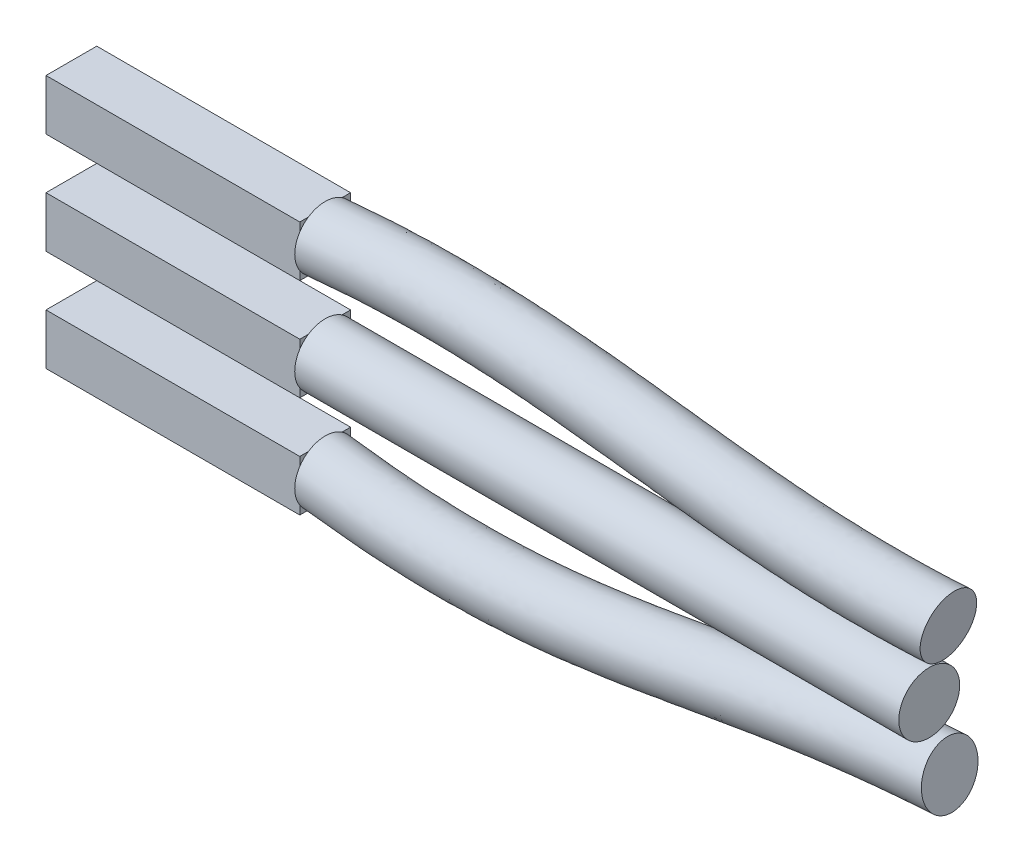
ISO-10303-21;
HEADER;
FILE_DESCRIPTION(('STEP AP214'),'2;1');
FILE_NAME('part.step','',(''),(''),'','','');
FILE_SCHEMA(('AUTOMOTIVE_DESIGN { 1 0 10303 214 1 1 1 1 }'));
ENDSEC;
DATA;
#1=APPLICATION_CONTEXT('core data for automotive mechanical design processes');
#2=APPLICATION_PROTOCOL_DEFINITION('international standard','automotive_design',2000,#1);
#3=PRODUCT_CONTEXT('',#1,'mechanical');
#4=PRODUCT('Part','Part','',(#3));
#5=PRODUCT_RELATED_PRODUCT_CATEGORY('part','',(#4));
#6=PRODUCT_DEFINITION_FORMATION('','',#4);
#7=PRODUCT_DEFINITION_CONTEXT('part definition',#1,'design');
#8=PRODUCT_DEFINITION('design','',#6,#7);
#9=PRODUCT_DEFINITION_SHAPE('','',#8);
#10=(LENGTH_UNIT() NAMED_UNIT(*) SI_UNIT(.MILLI.,.METRE.));
#11=(NAMED_UNIT(*) PLANE_ANGLE_UNIT() SI_UNIT($,.RADIAN.));
#12=(NAMED_UNIT(*) SI_UNIT($,.STERADIAN.) SOLID_ANGLE_UNIT());
#13=UNCERTAINTY_MEASURE_WITH_UNIT(LENGTH_MEASURE(1.E-05),#10,'distance_accuracy_value','');
#14=(GEOMETRIC_REPRESENTATION_CONTEXT(3) GLOBAL_UNCERTAINTY_ASSIGNED_CONTEXT((#13)) GLOBAL_UNIT_ASSIGNED_CONTEXT((#10,
#11,#12)) REPRESENTATION_CONTEXT('',''));
#15=CARTESIAN_POINT('',(0.,0.,0.));
#16=DIRECTION('',(0.,0.,1.));
#17=DIRECTION('',(1.,0.,0.));
#18=AXIS2_PLACEMENT_3D('',#15,#16,#17);
#19=CARTESIAN_POINT('',(5.01124009742201,3.10694238337395,1.));
#20=DIRECTION('',(-1.,0.,0.));
#21=DIRECTION('',(0.,0.,1.));
#22=AXIS2_PLACEMENT_3D('',#19,#20,#21);
#23=PLANE('',#22);
#24=CARTESIAN_POINT('',(5.01124009742201,2.60694238337396,0.5));
#25=DIRECTION('',(1.,0.,0.));
#26=DIRECTION('',(0.,0.,-1.));
#27=AXIS2_PLACEMENT_3D('',#24,#25,#26);
#28=CIRCLE('',#27,0.6);
#29=CARTESIAN_POINT('',(5.01124009742201,2.9386048624095,0.));
#30=VERTEX_POINT('',#29);
#31=CARTESIAN_POINT('',(5.01124009742201,3.10694238337395,0.168337520964433));
#32=VERTEX_POINT('',#31);
#33=EDGE_CURVE('E12',#30,#32,#28,.T.);
#34=ORIENTED_EDGE('',*,*,#33,.F.);
#35=DIRECTION('',(0.,1.,0.));
#36=VECTOR('',#35,1.);
#37=CARTESIAN_POINT('',(5.01124009742201,3.10694238337395,0.));
#38=LINE('',#37,#36);
#39=CARTESIAN_POINT('',(5.01124009742201,3.10694238337395,0.));
#40=VERTEX_POINT('',#39);
#41=EDGE_CURVE('E123',#30,#40,#38,.T.);
#42=ORIENTED_EDGE('',*,*,#41,.T.);
#43=DIRECTION('',(0.,0.,-1.));
#44=VECTOR('',#43,1.);
#45=CARTESIAN_POINT('',(5.01124009742201,3.10694238337395,1.));
#46=LINE('',#45,#44);
#47=EDGE_CURVE('E158',#32,#40,#46,.T.);
#48=ORIENTED_EDGE('',*,*,#47,.F.);
#49=EDGE_LOOP('',(#34,#42,#48));
#50=FACE_BOUND('',#49,.T.);
#51=ADVANCED_FACE('F46',(#50),#23,.F.);
#52=CARTESIAN_POINT('',(5.01124009742201,3.10694238337395,0.831662479035567));
#53=VERTEX_POINT('',#52);
#54=CARTESIAN_POINT('',(5.01124009742201,2.9386048624095,1.));
#55=VERTEX_POINT('',#54);
#56=EDGE_CURVE('E55',#53,#55,#28,.T.);
#57=ORIENTED_EDGE('',*,*,#56,.F.);
#58=CARTESIAN_POINT('',(5.01124009742201,3.10694238337395,1.));
#59=VERTEX_POINT('',#58);
#60=EDGE_CURVE('E50',#59,#53,#46,.T.);
#61=ORIENTED_EDGE('',*,*,#60,.F.);
#62=DIRECTION('',(0.,1.,0.));
#63=VECTOR('',#62,1.);
#64=CARTESIAN_POINT('',(5.01124009742201,3.10694238337395,1.));
#65=LINE('',#64,#63);
#66=EDGE_CURVE('E138',#55,#59,#65,.T.);
#67=ORIENTED_EDGE('',*,*,#66,.F.);
#68=EDGE_LOOP('',(#57,#61,#67));
#69=FACE_BOUND('',#68,.T.);
#70=ADVANCED_FACE('F182',(#69),#23,.F.);
#71=CARTESIAN_POINT('',(5.01124009742201,2.27527990433842,1.));
#72=VERTEX_POINT('',#71);
#73=CARTESIAN_POINT('',(5.01124009742201,2.10694238337398,0.831662479035564));
#74=VERTEX_POINT('',#73);
#75=EDGE_CURVE('E170',#72,#74,#28,.T.);
#76=ORIENTED_EDGE('',*,*,#75,.F.);
#77=CARTESIAN_POINT('',(5.01124009742201,2.10694238337398,1.));
#78=VERTEX_POINT('',#77);
#79=EDGE_CURVE('E133',#78,#72,#65,.T.);
#80=ORIENTED_EDGE('',*,*,#79,.F.);
#81=DIRECTION('',(0.,0.,-1.));
#82=VECTOR('',#81,1.);
#83=CARTESIAN_POINT('',(5.01124009742201,2.10694238337398,1.));
#84=LINE('',#83,#82);
#85=EDGE_CURVE('E152',#78,#74,#84,.T.);
#86=ORIENTED_EDGE('',*,*,#85,.T.);
#87=EDGE_LOOP('',(#76,#80,#86));
#88=FACE_BOUND('',#87,.T.);
#89=ADVANCED_FACE('F222',(#88),#23,.F.);
#90=CARTESIAN_POINT('',(5.01124009742201,2.10694238337398,0.168337520964436));
#91=VERTEX_POINT('',#90);
#92=CARTESIAN_POINT('',(5.01124009742201,2.27527990433842,0.));
#93=VERTEX_POINT('',#92);
#94=EDGE_CURVE('E64',#91,#93,#28,.T.);
#95=ORIENTED_EDGE('',*,*,#94,.F.);
#96=CARTESIAN_POINT('',(5.01124009742201,2.10694238337398,0.));
#97=VERTEX_POINT('',#96);
#98=EDGE_CURVE('E143',#91,#97,#84,.T.);
#99=ORIENTED_EDGE('',*,*,#98,.T.);
#100=EDGE_CURVE('E129',#97,#93,#38,.T.);
#101=ORIENTED_EDGE('',*,*,#100,.T.);
#102=EDGE_LOOP('',(#95,#99,#101));
#103=FACE_BOUND('',#102,.T.);
#104=ADVANCED_FACE('F48',(#103),#23,.F.);
#105=CARTESIAN_POINT('',(0.0112400974220052,3.10694238337395,1.));
#106=DIRECTION('',(0.,-1.,0.));
#107=DIRECTION('',(1.,0.,0.));
#108=AXIS2_PLACEMENT_3D('',#105,#106,#107);
#109=PLANE('',#108);
#110=DIRECTION('',(-1.,0.,0.));
#111=VECTOR('',#110,1.);
#112=CARTESIAN_POINT('',(0.0112400974220052,3.10694238337395,0.));
#113=LINE('',#112,#111);
#114=CARTESIAN_POINT('',(0.0112400974220052,3.10694238337395,0.));
#115=VERTEX_POINT('',#114);
#116=EDGE_CURVE('E145',#40,#115,#113,.T.);
#117=ORIENTED_EDGE('',*,*,#116,.T.);
#118=DIRECTION('',(0.,0.,-1.));
#119=VECTOR('',#118,1.);
#120=CARTESIAN_POINT('',(0.0112400974220052,3.10694238337395,1.));
#121=LINE('',#120,#119);
#122=CARTESIAN_POINT('',(0.0112400974220052,3.10694238337395,1.));
#123=VERTEX_POINT('',#122);
#124=EDGE_CURVE('E156',#123,#115,#121,.T.);
#125=ORIENTED_EDGE('',*,*,#124,.F.);
#126=DIRECTION('',(-1.,0.,0.));
#127=VECTOR('',#126,1.);
#128=CARTESIAN_POINT('',(0.0112400974220052,3.10694238337395,1.));
#129=LINE('',#128,#127);
#130=EDGE_CURVE('E136',#59,#123,#129,.T.);
#131=ORIENTED_EDGE('',*,*,#130,.F.);
#132=ORIENTED_EDGE('',*,*,#60,.T.);
#133=EDGE_CURVE('E163',#53,#32,#46,.T.);
#134=ORIENTED_EDGE('',*,*,#133,.T.);
#135=ORIENTED_EDGE('',*,*,#47,.T.);
#136=EDGE_LOOP('',(#117,#125,#131,#132,#134,#135));
#137=FACE_BOUND('',#136,.T.);
#138=ADVANCED_FACE('F205',(#137),#109,.F.);
#139=CARTESIAN_POINT('',(0.0112400974220054,2.10694238337398,1.));
#140=DIRECTION('',(1.,0.,0.));
#141=DIRECTION('',(0.,1.,0.));
#142=AXIS2_PLACEMENT_3D('',#139,#140,#141);
#143=PLANE('',#142);
#144=DIRECTION('',(0.,-1.,0.));
#145=VECTOR('',#144,1.);
#146=CARTESIAN_POINT('',(0.0112400974220054,2.10694238337398,0.));
#147=LINE('',#146,#145);
#148=CARTESIAN_POINT('',(0.0112400974220054,2.10694238337398,0.));
#149=VERTEX_POINT('',#148);
#150=EDGE_CURVE('E147',#115,#149,#147,.T.);
#151=ORIENTED_EDGE('',*,*,#150,.T.);
#152=DIRECTION('',(0.,0.,-1.));
#153=VECTOR('',#152,1.);
#154=CARTESIAN_POINT('',(0.0112400974220054,2.10694238337398,1.));
#155=LINE('',#154,#153);
#156=CARTESIAN_POINT('',(0.0112400974220054,2.10694238337398,1.));
#157=VERTEX_POINT('',#156);
#158=EDGE_CURVE('E154',#157,#149,#155,.T.);
#159=ORIENTED_EDGE('',*,*,#158,.F.);
#160=DIRECTION('',(0.,-1.,0.));
#161=VECTOR('',#160,1.);
#162=CARTESIAN_POINT('',(0.0112400974220054,2.10694238337398,1.));
#163=LINE('',#162,#161);
#164=EDGE_CURVE('E140',#123,#157,#163,.T.);
#165=ORIENTED_EDGE('',*,*,#164,.F.);
#166=ORIENTED_EDGE('',*,*,#124,.T.);
#167=EDGE_LOOP('',(#151,#159,#165,#166));
#168=FACE_BOUND('',#167,.T.);
#169=ADVANCED_FACE('F228',(#168),#143,.F.);
#170=CARTESIAN_POINT('',(5.01124009742201,2.10694238337398,1.));
#171=DIRECTION('',(0.,1.,0.));
#172=DIRECTION('',(-1.,0.,0.));
#173=AXIS2_PLACEMENT_3D('',#170,#171,#172);
#174=PLANE('',#173);
#175=DIRECTION('',(1.,0.,0.));
#176=VECTOR('',#175,1.);
#177=CARTESIAN_POINT('',(5.01124009742201,2.10694238337398,0.));
#178=LINE('',#177,#176);
#179=EDGE_CURVE('E149',#149,#97,#178,.T.);
#180=ORIENTED_EDGE('',*,*,#179,.T.);
#181=ORIENTED_EDGE('',*,*,#98,.F.);
#182=EDGE_CURVE('E71',#74,#91,#84,.T.);
#183=ORIENTED_EDGE('',*,*,#182,.F.);
#184=ORIENTED_EDGE('',*,*,#85,.F.);
#185=DIRECTION('',(1.,0.,0.));
#186=VECTOR('',#185,1.);
#187=CARTESIAN_POINT('',(5.01124009742201,2.10694238337398,1.));
#188=LINE('',#187,#186);
#189=EDGE_CURVE('E142',#157,#78,#188,.T.);
#190=ORIENTED_EDGE('',*,*,#189,.F.);
#191=ORIENTED_EDGE('',*,*,#158,.T.);
#192=EDGE_LOOP('',(#180,#181,#183,#184,#190,#191));
#193=FACE_BOUND('',#192,.T.);
#194=ADVANCED_FACE('F233',(#193),#174,.F.);
#195=CARTESIAN_POINT('',(0.,0.,1.));
#196=DIRECTION('',(0.,0.,-1.));
#197=DIRECTION('',(-1.,0.,0.));
#198=AXIS2_PLACEMENT_3D('',#195,#196,#197);
#199=PLANE('',#198);
#200=ORIENTED_EDGE('',*,*,#79,.T.);
#201=EDGE_CURVE('E137',#72,#55,#65,.T.);
#202=ORIENTED_EDGE('',*,*,#201,.T.);
#203=ORIENTED_EDGE('',*,*,#66,.T.);
#204=ORIENTED_EDGE('',*,*,#130,.T.);
#205=ORIENTED_EDGE('',*,*,#164,.T.);
#206=ORIENTED_EDGE('',*,*,#189,.T.);
#207=EDGE_LOOP('',(#200,#202,#203,#204,#205,#206));
#208=FACE_BOUND('',#207,.T.);
#209=ADVANCED_FACE('F186',(#208),#199,.F.);
#210=CARTESIAN_POINT('',(0.,0.,0.));
#211=DIRECTION('',(0.,0.,-1.));
#212=DIRECTION('',(-1.,0.,0.));
#213=AXIS2_PLACEMENT_3D('',#210,#211,#212);
#214=PLANE('',#213);
#215=ORIENTED_EDGE('',*,*,#100,.F.);
#216=ORIENTED_EDGE('',*,*,#179,.F.);
#217=ORIENTED_EDGE('',*,*,#150,.F.);
#218=ORIENTED_EDGE('',*,*,#116,.F.);
#219=ORIENTED_EDGE('',*,*,#41,.F.);
#220=EDGE_CURVE('E127',#93,#30,#38,.T.);
#221=ORIENTED_EDGE('',*,*,#220,.F.);
#222=EDGE_LOOP('',(#215,#216,#217,#218,#219,#221));
#223=FACE_BOUND('',#222,.T.);
#224=ADVANCED_FACE('F201',(#223),#214,.T.);
#225=CARTESIAN_POINT('',(5.01124009742201,2.60694238337396,0.5));
#226=DIRECTION('',(1.,0.,0.));
#227=DIRECTION('',(0.,0.,-1.));
#228=AXIS2_PLACEMENT_3D('',#225,#226,#227);
#229=PLANE('',#228);
#230=CARTESIAN_POINT('',(5.01124009742201,2.60694238337396,-0.1));
#231=VERTEX_POINT('',#230);
#232=EDGE_CURVE('E131',#93,#231,#28,.T.);
#233=ORIENTED_EDGE('',*,*,#232,.F.);
#234=ORIENTED_EDGE('',*,*,#220,.T.);
#235=EDGE_CURVE('E124',#231,#30,#28,.T.);
#236=ORIENTED_EDGE('',*,*,#235,.F.);
#237=EDGE_LOOP('',(#233,#234,#236));
#238=FACE_BOUND('',#237,.T.);
#239=ADVANCED_FACE('F196',(#238),#229,.F.);
#240=ORIENTED_EDGE('',*,*,#133,.F.);
#241=EDGE_CURVE('E57',#32,#53,#28,.T.);
#242=ORIENTED_EDGE('',*,*,#241,.F.);
#243=EDGE_LOOP('',(#240,#242));
#244=FACE_BOUND('',#243,.T.);
#245=ADVANCED_FACE('F207',(#244),#229,.F.);
#246=EDGE_CURVE('E190',#74,#91,#28,.T.);
#247=ORIENTED_EDGE('',*,*,#246,.F.);
#248=ORIENTED_EDGE('',*,*,#182,.T.);
#249=EDGE_LOOP('',(#247,#248));
#250=FACE_BOUND('',#249,.T.);
#251=ADVANCED_FACE('F209',(#250),#229,.F.);
#252=ORIENTED_EDGE('',*,*,#201,.F.);
#253=EDGE_CURVE('E179',#55,#72,#28,.T.);
#254=ORIENTED_EDGE('',*,*,#253,.F.);
#255=EDGE_LOOP('',(#252,#254));
#256=FACE_BOUND('',#255,.T.);
#257=ADVANCED_FACE('F189',(#256),#229,.F.);
#258=CARTESIAN_POINT('',(16.9663426984804,1.78408951680645,0.17781668416394));
#259=DIRECTION('',(0.991047996588389,-0.110184733399379,-0.0753869549978515));
#260=DIRECTION('',(-0.0749847972363037,0.00779496812448035,-0.997154210067514));
#261=AXIS2_PLACEMENT_3D('',#258,#259,#260);
#262=PLANE('',#261);
#263=CARTESIAN_POINT('',(16.9663426984804,1.78408951680645,0.17781668416394));
#264=DIRECTION('',(0.991047996588389,-0.110184733399379,-0.0753869549978515));
#265=DIRECTION('',(-0.0749847972363037,0.00779496812448035,-0.997154210067514));
#266=AXIS2_PLACEMENT_3D('',#263,#264,#265);
#267=CIRCLE('',#266,0.6);
#268=CARTESIAN_POINT('',(16.9213518201386,1.78876649768114,-0.420475841876569));
#269=VERTEX_POINT('',#268);
#270=EDGE_CURVE('E120',#269,#269,#267,.T.);
#271=ORIENTED_EDGE('',*,*,#270,.T.);
#272=EDGE_LOOP('',(#271));
#273=FACE_BOUND('',#272,.T.);
#274=ADVANCED_FACE('F121',(#273),#262,.T.);
#275=CARTESIAN_POINT('',(5.01124009742201,2.60694238337396,-0.1));
#276=CARTESIAN_POINT('',(7.51203000339992,2.85621876913738,-0.0999999994904398));
#277=CARTESIAN_POINT('',(9.39460318151192,2.66250917594463,-0.0976191679316499));
#278=CARTESIAN_POINT('',(13.0010633665015,2.14134050222167,-0.175321337821993));
#279=CARTESIAN_POINT('',(14.7261773934276,1.81311717588795,-0.255211010935427));
#280=CARTESIAN_POINT('',(16.9213518201386,1.78876649768114,-0.420475841876569));
#281=CARTESIAN_POINT('',(5.01124009742201,3.80694238337396,-0.1));
#282=CARTESIAN_POINT('',(7.63289708937771,4.05621876926597,-0.0999228241579928));
#283=CARTESIAN_POINT('',(9.64999884439833,3.83551499576757,-0.0989330580499224));
#284=CARTESIAN_POINT('',(13.3227024338646,3.29792032334377,-0.181859937031724));
#285=CARTESIAN_POINT('',(14.9702694909672,2.99337367941893,-0.262446127204415));
#286=CARTESIAN_POINT('',(17.0539023917853,2.98142316693537,-0.421120232695672));
#287=CARTESIAN_POINT('',(5.01124009742201,3.80694238337396,1.1));
#288=CARTESIAN_POINT('',(7.63212285121055,4.05614159400286,1.10007717584204));
#289=CARTESIAN_POINT('',(9.65696217241315,3.83588655012545,1.10119313361706));
#290=CARTESIAN_POINT('',(13.3667778446931,3.29299454857784,1.01746678940862));
#291=CARTESIAN_POINT('',(15.0412653597324,2.9842303245952,0.935568287188542));
#292=CARTESIAN_POINT('',(17.1438841484688,2.972069205186,0.775464819385346));
#293=CARTESIAN_POINT('',(5.01124009742201,2.60694238337396,1.1));
#294=CARTESIAN_POINT('',(7.51125576523276,2.85614159387373,1.10000000050946));
#295=CARTESIAN_POINT('',(9.40156650952595,2.66288073030261,1.10250702373527));
#296=CARTESIAN_POINT('',(13.0451387773309,2.13641472745564,1.02400538861841));
#297=CARTESIAN_POINT('',(14.7971732621794,1.80397382106404,0.942803403457741));
#298=CARTESIAN_POINT('',(17.0113335768221,1.77941253593176,0.776109210204449));
#299=CARTESIAN_POINT('',(5.01124009742201,1.40694238337396,1.1));
#300=CARTESIAN_POINT('',(7.39038867925497,1.65614159374459,1.09992282517688));
#301=CARTESIAN_POINT('',(9.14617084663874,1.48987491047977,1.10382091385348));
#302=CARTESIAN_POINT('',(12.7234997099686,0.979834906333444,1.0305439878282));
#303=CARTESIAN_POINT('',(14.5530811646264,0.623717317532876,0.95003851972694));
#304=CARTESIAN_POINT('',(16.8787830051755,0.586755866677523,0.776753601023552));
#305=CARTESIAN_POINT('',(5.01124009742201,1.40694238337396,-0.1));
#306=CARTESIAN_POINT('',(7.39116291742213,1.65621876900879,-0.100077174822887));
#307=CARTESIAN_POINT('',(9.13920751862551,1.48950335612169,-0.0963052778133775));
#308=CARTESIAN_POINT('',(12.6794242991385,0.984760681099567,-0.168782738612261));
#309=CARTESIAN_POINT('',(14.482085295888,0.632860672356969,-0.247975894666438));
#310=CARTESIAN_POINT('',(16.7888012484919,0.596109828426899,-0.419831451057467));
#311=CARTESIAN_POINT('',(5.01124009742201,2.60694238337396,-0.1));
#312=CARTESIAN_POINT('',(7.51203000339992,2.85621876913738,-0.0999999994904398));
#313=CARTESIAN_POINT('',(9.39460318151192,2.66250917594463,-0.0976191679316499));
#314=CARTESIAN_POINT('',(13.0010633665015,2.14134050222167,-0.175321337821993));
#315=CARTESIAN_POINT('',(14.7261773934276,1.81311717588795,-0.255211010935427));
#316=CARTESIAN_POINT('',(16.9213518201386,1.78876649768114,-0.420475841876569));
#317=(BOUNDED_SURFACE() B_SPLINE_SURFACE(3,3,((#275,#276,#277,#278,#279,#280),(#281,#282,#283,
#284,#285,#286),(#287,#288,#289,#290,#291,#292),(#293,#294,#295,#296,#297,#298),(#299,#300,#301,
#302,#303,#304),(#305,#306,#307,#308,#309,#310),(#311,#312,#313,#314,#315,#316)),.UNSPECIFIED.,
.T.,.F.,.F.) B_SPLINE_SURFACE_WITH_KNOTS((4,3,4),(4,2,4),(0.,0.5,1.),(0.,0.5,1.),
.UNSPECIFIED.) GEOMETRIC_REPRESENTATION_ITEM() RATIONAL_B_SPLINE_SURFACE(((1.,1.,1.,1.,1.,1.),
(0.333333333333333,0.333333333333333,0.333333333333333,0.333333333333333,0.333333333333333,
0.333333333333333),(0.333333333333333,0.333333333333333,0.333333333333333,0.333333333333333,
0.333333333333333,0.333333333333333),(1.,1.,1.,1.,1.,1.),(0.333333333333333,0.333333333333333,
0.333333333333333,0.333333333333333,0.333333333333333,0.333333333333333),(0.333333333333333,
0.333333333333333,0.333333333333333,0.333333333333333,0.333333333333333,0.333333333333333),(1.,
1.,1.,1.,1.,1.))) REPRESENTATION_ITEM('') SURFACE());
#318=ORIENTED_EDGE('',*,*,#270,.F.);
#319=EDGE_LOOP('',(#318));
#320=FACE_BOUND('',#319,.T.);
#321=ORIENTED_EDGE('',*,*,#235,.T.);
#322=ORIENTED_EDGE('',*,*,#33,.T.);
#323=ORIENTED_EDGE('',*,*,#241,.T.);
#324=ORIENTED_EDGE('',*,*,#56,.T.);
#325=ORIENTED_EDGE('',*,*,#253,.T.);
#326=ORIENTED_EDGE('',*,*,#75,.T.);
#327=ORIENTED_EDGE('',*,*,#246,.T.);
#328=ORIENTED_EDGE('',*,*,#94,.T.);
#329=ORIENTED_EDGE('',*,*,#232,.T.);
#330=EDGE_LOOP('',(#321,#322,#323,#324,#325,#326,#327,#328,#329));
#331=FACE_BOUND('',#330,.T.);
#332=ADVANCED_FACE('F177',(#320,#331),#317,.T.);
#333=CLOSED_SHELL('',(#51,#70,#89,#104,#138,#169,#194,#209,#224,#239,#245,#251,#257,#274,#332));
#334=MANIFOLD_SOLID_BREP('B2',#333);
#335=CARTESIAN_POINT('',(5.01124009742201,1.10694238337396,1.));
#336=DIRECTION('',(-1.,0.,0.));
#337=DIRECTION('',(0.,0.,1.));
#338=AXIS2_PLACEMENT_3D('',#335,#336,#337);
#339=PLANE('',#338);
#340=CARTESIAN_POINT('',(5.011240097422,0.606942383373964,0.5));
#341=DIRECTION('',(1.,0.,0.));
#342=DIRECTION('',(0.,0.,-1.));
#343=AXIS2_PLACEMENT_3D('',#340,#341,#342);
#344=CIRCLE('',#343,0.6);
#345=CARTESIAN_POINT('',(5.011240097422,0.938604862409504,0.));
#346=VERTEX_POINT('',#345);
#347=CARTESIAN_POINT('',(5.011240097422,1.10694238337396,0.168337520964449));
#348=VERTEX_POINT('',#347);
#349=EDGE_CURVE('E441',#346,#348,#344,.T.);
#350=ORIENTED_EDGE('',*,*,#349,.F.);
#351=DIRECTION('',(0.,1.,0.));
#352=VECTOR('',#351,1.);
#353=CARTESIAN_POINT('',(5.01124009742201,1.10694238337396,0.));
#354=LINE('',#353,#352);
#355=CARTESIAN_POINT('',(5.01124009742201,1.10694238337396,0.));
#356=VERTEX_POINT('',#355);
#357=EDGE_CURVE('E427',#346,#356,#354,.T.);
#358=ORIENTED_EDGE('',*,*,#357,.T.);
#359=DIRECTION('',(0.,0.,-1.));
#360=VECTOR('',#359,1.);
#361=CARTESIAN_POINT('',(5.01124009742201,1.10694238337396,1.));
#362=LINE('',#361,#360);
#363=EDGE_CURVE('E448',#348,#356,#362,.T.);
#364=ORIENTED_EDGE('',*,*,#363,.F.);
#365=EDGE_LOOP('',(#350,#358,#364));
#366=FACE_BOUND('',#365,.T.);
#367=ADVANCED_FACE('F351',(#366),#339,.F.);
#368=CARTESIAN_POINT('',(5.011240097422,1.10694238337396,0.831662479035551));
#369=VERTEX_POINT('',#368);
#370=CARTESIAN_POINT('',(5.011240097422,0.938604862409504,1.));
#371=VERTEX_POINT('',#370);
#372=EDGE_CURVE('E44',#369,#371,#344,.T.);
#373=ORIENTED_EDGE('',*,*,#372,.F.);
#374=CARTESIAN_POINT('',(5.01124009742201,1.10694238337396,1.));
#375=VERTEX_POINT('',#374);
#376=EDGE_CURVE('E355',#375,#369,#362,.T.);
#377=ORIENTED_EDGE('',*,*,#376,.F.);
#378=DIRECTION('',(0.,1.,0.));
#379=VECTOR('',#378,1.);
#380=CARTESIAN_POINT('',(5.01124009742201,1.10694238337396,1.));
#381=LINE('',#380,#379);
#382=EDGE_CURVE('E466',#371,#375,#381,.T.);
#383=ORIENTED_EDGE('',*,*,#382,.F.);
#384=EDGE_LOOP('',(#373,#377,#383));
#385=FACE_BOUND('',#384,.T.);
#386=ADVANCED_FACE('F508',(#385),#339,.F.);
#387=CARTESIAN_POINT('',(5.011240097422,0.275279904338424,1.));
#388=VERTEX_POINT('',#387);
#389=CARTESIAN_POINT('',(5.011240097422,0.106942383373968,0.831662479035545));
#390=VERTEX_POINT('',#389);
#391=EDGE_CURVE('E360',#388,#390,#344,.T.);
#392=ORIENTED_EDGE('',*,*,#391,.F.);
#393=CARTESIAN_POINT('',(5.01124009742201,0.106942383373968,1.));
#394=VERTEX_POINT('',#393);
#395=EDGE_CURVE('E465',#394,#388,#381,.T.);
#396=ORIENTED_EDGE('',*,*,#395,.F.);
#397=DIRECTION('',(0.,0.,-1.));
#398=VECTOR('',#397,1.);
#399=CARTESIAN_POINT('',(5.01124009742201,0.106942383373968,1.));
#400=LINE('',#399,#398);
#401=EDGE_CURVE('E479',#394,#390,#400,.T.);
#402=ORIENTED_EDGE('',*,*,#401,.T.);
#403=EDGE_LOOP('',(#392,#396,#402));
#404=FACE_BOUND('',#403,.T.);
#405=ADVANCED_FACE('F513',(#404),#339,.F.);
#406=CARTESIAN_POINT('',(5.011240097422,0.106942383373968,0.168337520964455));
#407=VERTEX_POINT('',#406);
#408=CARTESIAN_POINT('',(5.011240097422,0.275279904338424,0.));
#409=VERTEX_POINT('',#408);
#410=EDGE_CURVE('E369',#407,#409,#344,.T.);
#411=ORIENTED_EDGE('',*,*,#410,.F.);
#412=CARTESIAN_POINT('',(5.01124009742201,0.106942383373968,0.));
#413=VERTEX_POINT('',#412);
#414=EDGE_CURVE('E420',#407,#413,#400,.T.);
#415=ORIENTED_EDGE('',*,*,#414,.T.);
#416=EDGE_CURVE('E418',#413,#409,#354,.T.);
#417=ORIENTED_EDGE('',*,*,#416,.T.);
#418=EDGE_LOOP('',(#411,#415,#417));
#419=FACE_BOUND('',#418,.T.);
#420=ADVANCED_FACE('F353',(#419),#339,.F.);
#421=CARTESIAN_POINT('',(0.0112400974220056,1.10694238337396,1.));
#422=DIRECTION('',(0.,-1.,0.));
#423=DIRECTION('',(1.,0.,0.));
#424=AXIS2_PLACEMENT_3D('',#421,#422,#423);
#425=PLANE('',#424);
#426=DIRECTION('',(-1.,0.,0.));
#427=VECTOR('',#426,1.);
#428=CARTESIAN_POINT('',(0.0112400974220056,1.10694238337396,0.));
#429=LINE('',#428,#427);
#430=CARTESIAN_POINT('',(0.0112400974220056,1.10694238337396,0.));
#431=VERTEX_POINT('',#430);
#432=EDGE_CURVE('E424',#356,#431,#429,.T.);
#433=ORIENTED_EDGE('',*,*,#432,.T.);
#434=DIRECTION('',(0.,0.,-1.));
#435=VECTOR('',#434,1.);
#436=CARTESIAN_POINT('',(0.0112400974220056,1.10694238337396,1.));
#437=LINE('',#436,#435);
#438=CARTESIAN_POINT('',(0.0112400974220056,1.10694238337396,1.));
#439=VERTEX_POINT('',#438);
#440=EDGE_CURVE('E483',#439,#431,#437,.T.);
#441=ORIENTED_EDGE('',*,*,#440,.F.);
#442=DIRECTION('',(-1.,0.,0.));
#443=VECTOR('',#442,1.);
#444=CARTESIAN_POINT('',(0.0112400974220056,1.10694238337396,1.));
#445=LINE('',#444,#443);
#446=EDGE_CURVE('E467',#375,#439,#445,.T.);
#447=ORIENTED_EDGE('',*,*,#446,.F.);
#448=ORIENTED_EDGE('',*,*,#376,.T.);
#449=EDGE_CURVE('E447',#369,#348,#362,.T.);
#450=ORIENTED_EDGE('',*,*,#449,.T.);
#451=ORIENTED_EDGE('',*,*,#363,.T.);
#452=EDGE_LOOP('',(#433,#441,#447,#448,#450,#451));
#453=FACE_BOUND('',#452,.T.);
#454=ADVANCED_FACE('F492',(#453),#425,.F.);
#455=CARTESIAN_POINT('',(0.0112400974220054,0.106942383373967,1.));
#456=DIRECTION('',(1.,0.,0.));
#457=DIRECTION('',(0.,1.,0.));
#458=AXIS2_PLACEMENT_3D('',#455,#456,#457);
#459=PLANE('',#458);
#460=DIRECTION('',(0.,-1.,0.));
#461=VECTOR('',#460,1.);
#462=CARTESIAN_POINT('',(0.0112400974220054,0.106942383373967,0.));
#463=LINE('',#462,#461);
#464=CARTESIAN_POINT('',(0.0112400974220054,0.106942383373967,0.));
#465=VERTEX_POINT('',#464);
#466=EDGE_CURVE('E476',#431,#465,#463,.T.);
#467=ORIENTED_EDGE('',*,*,#466,.T.);
#468=DIRECTION('',(0.,0.,-1.));
#469=VECTOR('',#468,1.);
#470=CARTESIAN_POINT('',(0.0112400974220054,0.106942383373967,1.));
#471=LINE('',#470,#469);
#472=CARTESIAN_POINT('',(0.0112400974220054,0.106942383373967,1.));
#473=VERTEX_POINT('',#472);
#474=EDGE_CURVE('E481',#473,#465,#471,.T.);
#475=ORIENTED_EDGE('',*,*,#474,.F.);
#476=DIRECTION('',(0.,-1.,0.));
#477=VECTOR('',#476,1.);
#478=CARTESIAN_POINT('',(0.0112400974220054,0.106942383373967,1.));
#479=LINE('',#478,#477);
#480=EDGE_CURVE('E471',#439,#473,#479,.T.);
#481=ORIENTED_EDGE('',*,*,#480,.F.);
#482=ORIENTED_EDGE('',*,*,#440,.T.);
#483=EDGE_LOOP('',(#467,#475,#481,#482));
#484=FACE_BOUND('',#483,.T.);
#485=ADVANCED_FACE('F520',(#484),#459,.F.);
#486=CARTESIAN_POINT('',(5.01124009742201,0.106942383373968,1.));
#487=DIRECTION('',(0.,1.,0.));
#488=DIRECTION('',(-1.,0.,0.));
#489=AXIS2_PLACEMENT_3D('',#486,#487,#488);
#490=PLANE('',#489);
#491=DIRECTION('',(1.,0.,0.));
#492=VECTOR('',#491,1.);
#493=CARTESIAN_POINT('',(5.01124009742201,0.106942383373968,0.));
#494=LINE('',#493,#492);
#495=EDGE_CURVE('E468',#465,#413,#494,.T.);
#496=ORIENTED_EDGE('',*,*,#495,.T.);
#497=ORIENTED_EDGE('',*,*,#414,.F.);
#498=EDGE_CURVE('E376',#390,#407,#400,.T.);
#499=ORIENTED_EDGE('',*,*,#498,.F.);
#500=ORIENTED_EDGE('',*,*,#401,.F.);
#501=DIRECTION('',(1.,0.,0.));
#502=VECTOR('',#501,1.);
#503=CARTESIAN_POINT('',(5.01124009742201,0.106942383373968,1.));
#504=LINE('',#503,#502);
#505=EDGE_CURVE('E473',#473,#394,#504,.T.);
#506=ORIENTED_EDGE('',*,*,#505,.F.);
#507=ORIENTED_EDGE('',*,*,#474,.T.);
#508=EDGE_LOOP('',(#496,#497,#499,#500,#506,#507));
#509=FACE_BOUND('',#508,.T.);
#510=ADVANCED_FACE('F528',(#509),#490,.F.);
#511=CARTESIAN_POINT('',(0.,0.,1.));
#512=DIRECTION('',(0.,0.,-1.));
#513=DIRECTION('',(-1.,0.,0.));
#514=AXIS2_PLACEMENT_3D('',#511,#512,#513);
#515=PLANE('',#514);
#516=ORIENTED_EDGE('',*,*,#395,.T.);
#517=EDGE_CURVE('E462',#388,#371,#381,.T.);
#518=ORIENTED_EDGE('',*,*,#517,.T.);
#519=ORIENTED_EDGE('',*,*,#382,.T.);
#520=ORIENTED_EDGE('',*,*,#446,.T.);
#521=ORIENTED_EDGE('',*,*,#480,.T.);
#522=ORIENTED_EDGE('',*,*,#505,.T.);
#523=EDGE_LOOP('',(#516,#518,#519,#520,#521,#522));
#524=FACE_BOUND('',#523,.T.);
#525=ADVANCED_FACE('F525',(#524),#515,.F.);
#526=CARTESIAN_POINT('',(0.,0.,0.));
#527=DIRECTION('',(0.,0.,-1.));
#528=DIRECTION('',(-1.,0.,0.));
#529=AXIS2_PLACEMENT_3D('',#526,#527,#528);
#530=PLANE('',#529);
#531=ORIENTED_EDGE('',*,*,#416,.F.);
#532=ORIENTED_EDGE('',*,*,#495,.F.);
#533=ORIENTED_EDGE('',*,*,#466,.F.);
#534=ORIENTED_EDGE('',*,*,#432,.F.);
#535=ORIENTED_EDGE('',*,*,#357,.F.);
#536=EDGE_CURVE('E425',#409,#346,#354,.T.);
#537=ORIENTED_EDGE('',*,*,#536,.F.);
#538=EDGE_LOOP('',(#531,#532,#533,#534,#535,#537));
#539=FACE_BOUND('',#538,.T.);
#540=ADVANCED_FACE('F431',(#539),#530,.T.);
#541=CARTESIAN_POINT('',(5.011240097422,0.606942383373964,0.5));
#542=DIRECTION('',(1.,0.,0.));
#543=DIRECTION('',(0.,0.,-1.));
#544=AXIS2_PLACEMENT_3D('',#541,#542,#543);
#545=PLANE('',#544);
#546=EDGE_CURVE('E436',#409,#346,#344,.T.);
#547=ORIENTED_EDGE('',*,*,#546,.F.);
#548=ORIENTED_EDGE('',*,*,#536,.T.);
#549=EDGE_LOOP('',(#547,#548));
#550=FACE_BOUND('',#549,.T.);
#551=ADVANCED_FACE('F437',(#550),#545,.F.);
#552=ORIENTED_EDGE('',*,*,#449,.F.);
#553=EDGE_CURVE('E362',#348,#369,#344,.T.);
#554=ORIENTED_EDGE('',*,*,#553,.F.);
#555=EDGE_LOOP('',(#552,#554));
#556=FACE_BOUND('',#555,.T.);
#557=ADVANCED_FACE('F496',(#556),#545,.F.);
#558=EDGE_CURVE('E440',#390,#407,#344,.T.);
#559=ORIENTED_EDGE('',*,*,#558,.F.);
#560=ORIENTED_EDGE('',*,*,#498,.T.);
#561=EDGE_LOOP('',(#559,#560));
#562=FACE_BOUND('',#561,.T.);
#563=ADVANCED_FACE('F498',(#562),#545,.F.);
#564=CARTESIAN_POINT('',(16.911240097422,0.606942383373964,0.5));
#565=DIRECTION('',(-1.,0.,0.));
#566=DIRECTION('',(0.,0.,1.));
#567=AXIS2_PLACEMENT_3D('',#564,#565,#566);
#568=CYLINDRICAL_SURFACE('',#567,0.6);
#569=CARTESIAN_POINT('',(16.911240097422,0.606942383373964,0.5));
#570=DIRECTION('',(1.,0.,0.));
#571=DIRECTION('',(0.,0.,-1.));
#572=AXIS2_PLACEMENT_3D('',#569,#570,#571);
#573=CIRCLE('',#572,0.6);
#574=CARTESIAN_POINT('',(16.911240097422,0.606942383373964,-0.0999999999999999));
#575=VERTEX_POINT('',#574);
#576=EDGE_CURVE('E451',#575,#575,#573,.T.);
#577=ORIENTED_EDGE('',*,*,#576,.F.);
#578=EDGE_LOOP('',(#577));
#579=FACE_BOUND('',#578,.T.);
#580=ORIENTED_EDGE('',*,*,#349,.T.);
#581=ORIENTED_EDGE('',*,*,#553,.T.);
#582=ORIENTED_EDGE('',*,*,#372,.T.);
#583=EDGE_CURVE('E454',#371,#388,#344,.T.);
#584=ORIENTED_EDGE('',*,*,#583,.T.);
#585=ORIENTED_EDGE('',*,*,#391,.T.);
#586=ORIENTED_EDGE('',*,*,#558,.T.);
#587=ORIENTED_EDGE('',*,*,#410,.T.);
#588=ORIENTED_EDGE('',*,*,#546,.T.);
#589=EDGE_LOOP('',(#580,#581,#582,#584,#585,#586,#587,#588));
#590=FACE_BOUND('',#589,.T.);
#591=ADVANCED_FACE('F443',(#579,#590),#568,.T.);
#592=CARTESIAN_POINT('',(16.911240097422,0.606942383373964,0.5));
#593=DIRECTION('',(1.,0.,0.));
#594=DIRECTION('',(0.,0.,-1.));
#595=AXIS2_PLACEMENT_3D('',#592,#593,#594);
#596=PLANE('',#595);
#597=ORIENTED_EDGE('',*,*,#576,.T.);
#598=EDGE_LOOP('',(#597));
#599=FACE_BOUND('',#598,.T.);
#600=ADVANCED_FACE('F540',(#599),#596,.T.);
#601=ORIENTED_EDGE('',*,*,#517,.F.);
#602=ORIENTED_EDGE('',*,*,#583,.F.);
#603=EDGE_LOOP('',(#601,#602));
#604=FACE_BOUND('',#603,.T.);
#605=ADVANCED_FACE('F460',(#604),#545,.F.);
#606=CLOSED_SHELL('',(#367,#386,#405,#420,#454,#485,#510,#525,#540,#551,#557,#563,#591,#600,#605));
#607=MANIFOLD_SOLID_BREP('B6',#606);
#608=CARTESIAN_POINT('',(5.011240097422,-1.89305761662604,1.));
#609=DIRECTION('',(-1.,0.,0.));
#610=DIRECTION('',(0.,0.,1.));
#611=AXIS2_PLACEMENT_3D('',#608,#609,#610);
#612=PLANE('',#611);
#613=CARTESIAN_POINT('',(5.011240097422,-1.39305761662604,0.5));
#614=DIRECTION('',(1.,0.,0.));
#615=DIRECTION('',(0.,0.,-1.));
#616=AXIS2_PLACEMENT_3D('',#613,#614,#615);
#617=CIRCLE('',#616,0.6);
#618=CARTESIAN_POINT('',(5.011240097422,-1.0613951375905,0.));
#619=VERTEX_POINT('',#618);
#620=CARTESIAN_POINT('',(5.011240097422,-0.893057616626037,0.16833752096446));
#621=VERTEX_POINT('',#620);
#622=EDGE_CURVE('E349',#619,#621,#617,.T.);
#623=ORIENTED_EDGE('',*,*,#622,.F.);
#624=DIRECTION('',(0.,1.,0.));
#625=VECTOR('',#624,1.);
#626=CARTESIAN_POINT('',(5.011240097422,-1.89305761662604,0.));
#627=LINE('',#626,#625);
#628=CARTESIAN_POINT('',(5.011240097422,-0.893057616626037,0.));
#629=VERTEX_POINT('',#628);
#630=EDGE_CURVE('E710',#619,#629,#627,.T.);
#631=ORIENTED_EDGE('',*,*,#630,.T.);
#632=DIRECTION('',(0.,0.,-1.));
#633=VECTOR('',#632,1.);
#634=CARTESIAN_POINT('',(5.011240097422,-0.893057616626037,1.));
#635=LINE('',#634,#633);
#636=EDGE_CURVE('E745',#621,#629,#635,.T.);
#637=ORIENTED_EDGE('',*,*,#636,.F.);
#638=EDGE_LOOP('',(#623,#631,#637));
#639=FACE_BOUND('',#638,.T.);
#640=ADVANCED_FACE('F633',(#639),#612,.F.);
#641=CARTESIAN_POINT('',(5.011240097422,-0.893057616626037,0.83166247903554));
#642=VERTEX_POINT('',#641);
#643=CARTESIAN_POINT('',(5.011240097422,-1.0613951375905,1.));
#644=VERTEX_POINT('',#643);
#645=EDGE_CURVE('E642',#642,#644,#617,.T.);
#646=ORIENTED_EDGE('',*,*,#645,.F.);
#647=CARTESIAN_POINT('',(5.011240097422,-0.893057616626037,1.));
#648=VERTEX_POINT('',#647);
#649=EDGE_CURVE('E637',#648,#642,#635,.T.);
#650=ORIENTED_EDGE('',*,*,#649,.F.);
#651=DIRECTION('',(0.,1.,0.));
#652=VECTOR('',#651,1.);
#653=CARTESIAN_POINT('',(5.011240097422,-1.89305761662604,1.));
#654=LINE('',#653,#652);
#655=EDGE_CURVE('E725',#644,#648,#654,.T.);
#656=ORIENTED_EDGE('',*,*,#655,.F.);
#657=EDGE_LOOP('',(#646,#650,#656));
#658=FACE_BOUND('',#657,.T.);
#659=ADVANCED_FACE('F769',(#658),#612,.F.);
#660=CARTESIAN_POINT('',(5.011240097422,-1.72472009566158,1.));
#661=VERTEX_POINT('',#660);
#662=CARTESIAN_POINT('',(5.011240097422,-1.89305761662604,0.831662479035539));
#663=VERTEX_POINT('',#662);
#664=EDGE_CURVE('E757',#661,#663,#617,.T.);
#665=ORIENTED_EDGE('',*,*,#664,.F.);
#666=CARTESIAN_POINT('',(5.011240097422,-1.89305761662604,1.));
#667=VERTEX_POINT('',#666);
#668=EDGE_CURVE('E720',#667,#661,#654,.T.);
#669=ORIENTED_EDGE('',*,*,#668,.F.);
#670=DIRECTION('',(0.,0.,-1.));
#671=VECTOR('',#670,1.);
#672=CARTESIAN_POINT('',(5.011240097422,-1.89305761662604,1.));
#673=LINE('',#672,#671);
#674=EDGE_CURVE('E739',#667,#663,#673,.T.);
#675=ORIENTED_EDGE('',*,*,#674,.T.);
#676=EDGE_LOOP('',(#665,#669,#675));
#677=FACE_BOUND('',#676,.T.);
#678=ADVANCED_FACE('F809',(#677),#612,.F.);
#679=CARTESIAN_POINT('',(5.011240097422,-1.89305761662604,0.168337520964461));
#680=VERTEX_POINT('',#679);
#681=CARTESIAN_POINT('',(5.011240097422,-1.72472009566158,0.));
#682=VERTEX_POINT('',#681);
#683=EDGE_CURVE('E651',#680,#682,#617,.T.);
#684=ORIENTED_EDGE('',*,*,#683,.F.);
#685=CARTESIAN_POINT('',(5.011240097422,-1.89305761662604,0.));
#686=VERTEX_POINT('',#685);
#687=EDGE_CURVE('E730',#680,#686,#673,.T.);
#688=ORIENTED_EDGE('',*,*,#687,.T.);
#689=EDGE_CURVE('E716',#686,#682,#627,.T.);
#690=ORIENTED_EDGE('',*,*,#689,.T.);
#691=EDGE_LOOP('',(#684,#688,#690));
#692=FACE_BOUND('',#691,.T.);
#693=ADVANCED_FACE('F635',(#692),#612,.F.);
#694=CARTESIAN_POINT('',(5.011240097422,-0.893057616626037,1.));
#695=DIRECTION('',(0.,-1.,0.));
#696=DIRECTION('',(1.,0.,0.));
#697=AXIS2_PLACEMENT_3D('',#694,#695,#696);
#698=PLANE('',#697);
#699=DIRECTION('',(-1.,0.,0.));
#700=VECTOR('',#699,1.);
#701=CARTESIAN_POINT('',(5.011240097422,-0.893057616626037,0.));
#702=LINE('',#701,#700);
#703=CARTESIAN_POINT('',(0.0112400974220053,-0.893057616626038,0.));
#704=VERTEX_POINT('',#703);
#705=EDGE_CURVE('E732',#629,#704,#702,.T.);
#706=ORIENTED_EDGE('',*,*,#705,.T.);
#707=DIRECTION('',(0.,0.,-1.));
#708=VECTOR('',#707,1.);
#709=CARTESIAN_POINT('',(0.0112400974220053,-0.893057616626038,1.));
#710=LINE('',#709,#708);
#711=CARTESIAN_POINT('',(0.0112400974220053,-0.893057616626038,1.));
#712=VERTEX_POINT('',#711);
#713=EDGE_CURVE('E743',#712,#704,#710,.T.);
#714=ORIENTED_EDGE('',*,*,#713,.F.);
#715=DIRECTION('',(-1.,0.,0.));
#716=VECTOR('',#715,1.);
#717=CARTESIAN_POINT('',(5.011240097422,-0.893057616626037,1.));
#718=LINE('',#717,#716);
#719=EDGE_CURVE('E723',#648,#712,#718,.T.);
#720=ORIENTED_EDGE('',*,*,#719,.F.);
#721=ORIENTED_EDGE('',*,*,#649,.T.);
#722=EDGE_CURVE('E750',#642,#621,#635,.T.);
#723=ORIENTED_EDGE('',*,*,#722,.T.);
#724=ORIENTED_EDGE('',*,*,#636,.T.);
#725=EDGE_LOOP('',(#706,#714,#720,#721,#723,#724));
#726=FACE_BOUND('',#725,.T.);
#727=ADVANCED_FACE('F792',(#726),#698,.F.);
#728=CARTESIAN_POINT('',(0.0112400974220053,-0.893057616626038,1.));
#729=DIRECTION('',(1.,0.,0.));
#730=DIRECTION('',(0.,1.,0.));
#731=AXIS2_PLACEMENT_3D('',#728,#729,#730);
#732=PLANE('',#731);
#733=DIRECTION('',(0.,-1.,0.));
#734=VECTOR('',#733,1.);
#735=CARTESIAN_POINT('',(0.0112400974220053,-0.893057616626038,0.));
#736=LINE('',#735,#734);
#737=CARTESIAN_POINT('',(0.0112400974220054,-1.89305761662604,0.));
#738=VERTEX_POINT('',#737);
#739=EDGE_CURVE('E734',#704,#738,#736,.T.);
#740=ORIENTED_EDGE('',*,*,#739,.T.);
#741=DIRECTION('',(0.,0.,-1.));
#742=VECTOR('',#741,1.);
#743=CARTESIAN_POINT('',(0.0112400974220054,-1.89305761662604,1.));
#744=LINE('',#743,#742);
#745=CARTESIAN_POINT('',(0.0112400974220054,-1.89305761662604,1.));
#746=VERTEX_POINT('',#745);
#747=EDGE_CURVE('E741',#746,#738,#744,.T.);
#748=ORIENTED_EDGE('',*,*,#747,.F.);
#749=DIRECTION('',(0.,-1.,0.));
#750=VECTOR('',#749,1.);
#751=CARTESIAN_POINT('',(0.0112400974220053,-0.893057616626038,1.));
#752=LINE('',#751,#750);
#753=EDGE_CURVE('E727',#712,#746,#752,.T.);
#754=ORIENTED_EDGE('',*,*,#753,.F.);
#755=ORIENTED_EDGE('',*,*,#713,.T.);
#756=EDGE_LOOP('',(#740,#748,#754,#755));
#757=FACE_BOUND('',#756,.T.);
#758=ADVANCED_FACE('F815',(#757),#732,.F.);
#759=CARTESIAN_POINT('',(5.011240097422,-1.89305761662604,1.));
#760=DIRECTION('',(0.,1.,0.));
#761=DIRECTION('',(-1.,0.,0.));
#762=AXIS2_PLACEMENT_3D('',#759,#760,#761);
#763=PLANE('',#762);
#764=DIRECTION('',(1.,0.,0.));
#765=VECTOR('',#764,1.);
#766=CARTESIAN_POINT('',(5.011240097422,-1.89305761662604,0.));
#767=LINE('',#766,#765);
#768=EDGE_CURVE('E736',#738,#686,#767,.T.);
#769=ORIENTED_EDGE('',*,*,#768,.T.);
#770=ORIENTED_EDGE('',*,*,#687,.F.);
#771=EDGE_CURVE('E658',#663,#680,#673,.T.);
#772=ORIENTED_EDGE('',*,*,#771,.F.);
#773=ORIENTED_EDGE('',*,*,#674,.F.);
#774=DIRECTION('',(1.,0.,0.));
#775=VECTOR('',#774,1.);
#776=CARTESIAN_POINT('',(5.011240097422,-1.89305761662604,1.));
#777=LINE('',#776,#775);
#778=EDGE_CURVE('E729',#746,#667,#777,.T.);
#779=ORIENTED_EDGE('',*,*,#778,.F.);
#780=ORIENTED_EDGE('',*,*,#747,.T.);
#781=EDGE_LOOP('',(#769,#770,#772,#773,#779,#780));
#782=FACE_BOUND('',#781,.T.);
#783=ADVANCED_FACE('F820',(#782),#763,.F.);
#784=CARTESIAN_POINT('',(0.,0.,1.));
#785=DIRECTION('',(0.,0.,1.));
#786=DIRECTION('',(1.,0.,0.));
#787=AXIS2_PLACEMENT_3D('',#784,#785,#786);
#788=PLANE('',#787);
#789=ORIENTED_EDGE('',*,*,#668,.T.);
#790=EDGE_CURVE('E724',#661,#644,#654,.T.);
#791=ORIENTED_EDGE('',*,*,#790,.T.);
#792=ORIENTED_EDGE('',*,*,#655,.T.);
#793=ORIENTED_EDGE('',*,*,#719,.T.);
#794=ORIENTED_EDGE('',*,*,#753,.T.);
#795=ORIENTED_EDGE('',*,*,#778,.T.);
#796=EDGE_LOOP('',(#789,#791,#792,#793,#794,#795));
#797=FACE_BOUND('',#796,.T.);
#798=ADVANCED_FACE('F773',(#797),#788,.T.);
#799=CARTESIAN_POINT('',(0.,0.,0.));
#800=DIRECTION('',(0.,0.,1.));
#801=DIRECTION('',(1.,0.,0.));
#802=AXIS2_PLACEMENT_3D('',#799,#800,#801);
#803=PLANE('',#802);
#804=ORIENTED_EDGE('',*,*,#689,.F.);
#805=ORIENTED_EDGE('',*,*,#768,.F.);
#806=ORIENTED_EDGE('',*,*,#739,.F.);
#807=ORIENTED_EDGE('',*,*,#705,.F.);
#808=ORIENTED_EDGE('',*,*,#630,.F.);
#809=EDGE_CURVE('E714',#682,#619,#627,.T.);
#810=ORIENTED_EDGE('',*,*,#809,.F.);
#811=EDGE_LOOP('',(#804,#805,#806,#807,#808,#810));
#812=FACE_BOUND('',#811,.T.);
#813=ADVANCED_FACE('F788',(#812),#803,.F.);
#814=CARTESIAN_POINT('',(5.011240097422,-1.39305761662604,0.5));
#815=DIRECTION('',(1.,0.,0.));
#816=DIRECTION('',(0.,0.,-1.));
#817=AXIS2_PLACEMENT_3D('',#814,#815,#816);
#818=PLANE('',#817);
#819=CARTESIAN_POINT('',(5.011240097422,-1.39305761662604,-0.0999999999999999));
#820=VERTEX_POINT('',#819);
#821=EDGE_CURVE('E718',#682,#820,#617,.T.);
#822=ORIENTED_EDGE('',*,*,#821,.F.);
#823=ORIENTED_EDGE('',*,*,#809,.T.);
#824=EDGE_CURVE('E711',#820,#619,#617,.T.);
#825=ORIENTED_EDGE('',*,*,#824,.F.);
#826=EDGE_LOOP('',(#822,#823,#825));
#827=FACE_BOUND('',#826,.T.);
#828=ADVANCED_FACE('F783',(#827),#818,.F.);
#829=ORIENTED_EDGE('',*,*,#722,.F.);
#830=EDGE_CURVE('E644',#621,#642,#617,.T.);
#831=ORIENTED_EDGE('',*,*,#830,.F.);
#832=EDGE_LOOP('',(#829,#831));
#833=FACE_BOUND('',#832,.T.);
#834=ADVANCED_FACE('F794',(#833),#818,.F.);
#835=EDGE_CURVE('E777',#663,#680,#617,.T.);
#836=ORIENTED_EDGE('',*,*,#835,.F.);
#837=ORIENTED_EDGE('',*,*,#771,.T.);
#838=EDGE_LOOP('',(#836,#837));
#839=FACE_BOUND('',#838,.T.);
#840=ADVANCED_FACE('F796',(#839),#818,.F.);
#841=ORIENTED_EDGE('',*,*,#790,.F.);
#842=EDGE_CURVE('E766',#644,#661,#617,.T.);
#843=ORIENTED_EDGE('',*,*,#842,.F.);
#844=EDGE_LOOP('',(#841,#843));
#845=FACE_BOUND('',#844,.T.);
#846=ADVANCED_FACE('F776',(#845),#818,.F.);
#847=CARTESIAN_POINT('',(16.911240097422,-0.820288638474054,0.097152995249731));
#848=DIRECTION('',(0.98955100518545,0.122351750163721,-0.0762814352797524));
#849=DIRECTION('',(-0.0760910853706051,-0.00623439199115066,-0.997081380371544));
#850=AXIS2_PLACEMENT_3D('',#847,#848,#849);
#851=PLANE('',#850);
#852=CARTESIAN_POINT('',(16.911240097422,-0.820288638474054,0.097152995249731));
#853=DIRECTION('',(0.98955100518545,0.122351750163721,-0.0762814352797524));
#854=DIRECTION('',(-0.0760910853706051,-0.00623439199115066,-0.997081380371544));
#855=AXIS2_PLACEMENT_3D('',#852,#853,#854);
#856=CIRCLE('',#855,0.6);
#857=CARTESIAN_POINT('',(16.8655854461996,-0.824029273668744,-0.501095832973196));
#858=VERTEX_POINT('',#857);
#859=EDGE_CURVE('E707',#858,#858,#856,.T.);
#860=ORIENTED_EDGE('',*,*,#859,.T.);
#861=EDGE_LOOP('',(#860));
#862=FACE_BOUND('',#861,.T.);
#863=ADVANCED_FACE('F708',(#862),#851,.T.);
#864=CARTESIAN_POINT('',(5.011240097422,-1.39305761662604,-0.0999999999999999));
#865=CARTESIAN_POINT('',(7.55419822498258,-1.72805729770996,-0.0999999996056763));
#866=CARTESIAN_POINT('',(9.33046875483372,-1.57473400591533,-0.109853543074589));
#867=CARTESIAN_POINT('',(12.7953939240441,-1.11355641182337,-0.219719014100577));
#868=CARTESIAN_POINT('',(14.4870619525863,-0.804181238793782,-0.319705730262157));
#869=CARTESIAN_POINT('',(16.8655854461996,-0.824029273668744,-0.501095832973195));
#870=CARTESIAN_POINT('',(5.011240097422,-0.193057616626038,-0.0999999999999999));
#871=CARTESIAN_POINT('',(7.43427618456027,-0.528057297428925,-0.0996002478989893));
#872=CARTESIAN_POINT('',(9.05480647904656,-0.406214252967094,-0.10591047017981));
#873=CARTESIAN_POINT('',(12.4467722821986,0.03525399068908,-0.207833607038526));
#874=CARTESIAN_POINT('',(14.2324481082264,0.37347354358419,-0.309001168703646));
#875=CARTESIAN_POINT('',(16.7186211818237,0.366931389614162,-0.497327078646731));
#876=CARTESIAN_POINT('',(5.011240097422,-0.193057616626038,1.1));
#877=CARTESIAN_POINT('',(7.43731067061087,-0.528457049216941,1.1003997521026));
#878=CARTESIAN_POINT('',(9.07159071159067,-0.406984785474219,1.09415868682238));
#879=CARTESIAN_POINT('',(12.5055216393711,0.0399881033312327,0.99090505795275));
#880=CARTESIAN_POINT('',(14.3133860310432,0.381041360009365,0.888287426170442));
#881=CARTESIAN_POINT('',(16.8099304842684,0.374412660003543,0.699170577799122));
#882=CARTESIAN_POINT('',(5.011240097422,-1.39305761662604,1.1));
#883=CARTESIAN_POINT('',(7.55723271103318,-1.72845704949897,1.10000000039568));
#884=CARTESIAN_POINT('',(9.3472529873786,-1.57550453842226,1.09021561392753));
#885=CARTESIAN_POINT('',(12.8541432812159,-1.10882229918141,0.979019650890771));
#886=CARTESIAN_POINT('',(14.567999875403,-0.796613422367895,0.877582864612515));
#887=CARTESIAN_POINT('',(16.9568947486444,-0.816548003279363,0.695401823472657));
#888=CARTESIAN_POINT('',(5.011240097422,-2.59305761662604,1.1));
#889=CARTESIAN_POINT('',(7.67715475145549,-2.928457049781,1.09960024868876));
#890=CARTESIAN_POINT('',(9.62291526316653,-2.74402429137031,1.08627254103268));
#891=CARTESIAN_POINT('',(13.2027649230606,-2.25763270169405,0.967134243828792));
#892=CARTESIAN_POINT('',(14.8226137197629,-1.97426820474515,0.866878303054587));
#893=CARTESIAN_POINT('',(17.1038590130203,-2.00750866656227,0.691633069146193));
#894=CARTESIAN_POINT('',(5.011240097422,-2.59305761662604,-0.0999999999999999));
#895=CARTESIAN_POINT('',(7.67412026540489,-2.928057297991,-0.100399751312363));
#896=CARTESIAN_POINT('',(9.60613103062088,-2.74325375886357,-0.113796615969368));
#897=CARTESIAN_POINT('',(13.1440155658896,-2.26236681433582,-0.231604421162628));
#898=CARTESIAN_POINT('',(14.7416757969461,-1.98183602117175,-0.330410291820668));
#899=CARTESIAN_POINT('',(17.0125497105756,-2.01498993695165,-0.50486458729966));
#900=CARTESIAN_POINT('',(5.011240097422,-1.39305761662604,-0.0999999999999999));
#901=CARTESIAN_POINT('',(7.55419822498258,-1.72805729770996,-0.0999999996056763));
#902=CARTESIAN_POINT('',(9.33046875483372,-1.57473400591533,-0.109853543074589));
#903=CARTESIAN_POINT('',(12.7953939240441,-1.11355641182337,-0.219719014100577));
#904=CARTESIAN_POINT('',(14.4870619525863,-0.804181238793782,-0.319705730262157));
#905=CARTESIAN_POINT('',(16.8655854461996,-0.824029273668744,-0.501095832973195));
#906=(BOUNDED_SURFACE() B_SPLINE_SURFACE(3,3,((#864,#865,#866,#867,#868,#869),(#870,#871,#872,
#873,#874,#875),(#876,#877,#878,#879,#880,#881),(#882,#883,#884,#885,#886,#887),(#888,#889,#890,
#891,#892,#893),(#894,#895,#896,#897,#898,#899),(#900,#901,#902,#903,#904,#905)),.UNSPECIFIED.,
.T.,.F.,.F.) B_SPLINE_SURFACE_WITH_KNOTS((4,3,4),(4,2,4),(0.,0.5,1.),(0.,0.5,1.),
.UNSPECIFIED.) GEOMETRIC_REPRESENTATION_ITEM() RATIONAL_B_SPLINE_SURFACE(((1.,1.,1.,1.,1.,1.),
(0.333333333333333,0.333333333333333,0.333333333333333,0.333333333333333,0.333333333333333,
0.333333333333333),(0.333333333333333,0.333333333333333,0.333333333333333,0.333333333333333,
0.333333333333333,0.333333333333333),(1.,1.,1.,1.,1.,1.),(0.333333333333333,0.333333333333333,
0.333333333333333,0.333333333333333,0.333333333333333,0.333333333333333),(0.333333333333333,
0.333333333333333,0.333333333333333,0.333333333333333,0.333333333333333,0.333333333333333),(1.,
1.,1.,1.,1.,1.))) REPRESENTATION_ITEM('') SURFACE());
#907=ORIENTED_EDGE('',*,*,#859,.F.);
#908=EDGE_LOOP('',(#907));
#909=FACE_BOUND('',#908,.T.);
#910=ORIENTED_EDGE('',*,*,#824,.T.);
#911=ORIENTED_EDGE('',*,*,#622,.T.);
#912=ORIENTED_EDGE('',*,*,#830,.T.);
#913=ORIENTED_EDGE('',*,*,#645,.T.);
#914=ORIENTED_EDGE('',*,*,#842,.T.);
#915=ORIENTED_EDGE('',*,*,#664,.T.);
#916=ORIENTED_EDGE('',*,*,#835,.T.);
#917=ORIENTED_EDGE('',*,*,#683,.T.);
#918=ORIENTED_EDGE('',*,*,#821,.T.);
#919=EDGE_LOOP('',(#910,#911,#912,#913,#914,#915,#916,#917,#918));
#920=FACE_BOUND('',#919,.T.);
#921=ADVANCED_FACE('F764',(#909,#920),#906,.T.);
#922=CLOSED_SHELL('',(#640,#659,#678,#693,#727,#758,#783,#798,#813,#828,#834,#840,#846,#863,#921));
#923=MANIFOLD_SOLID_BREP('B38',#922);
#924=ADVANCED_BREP_SHAPE_REPRESENTATION('',(#18,#334,#607,#923),#14);
#925=SHAPE_DEFINITION_REPRESENTATION(#9,#924);
ENDSEC;
END-ISO-10303-21;
